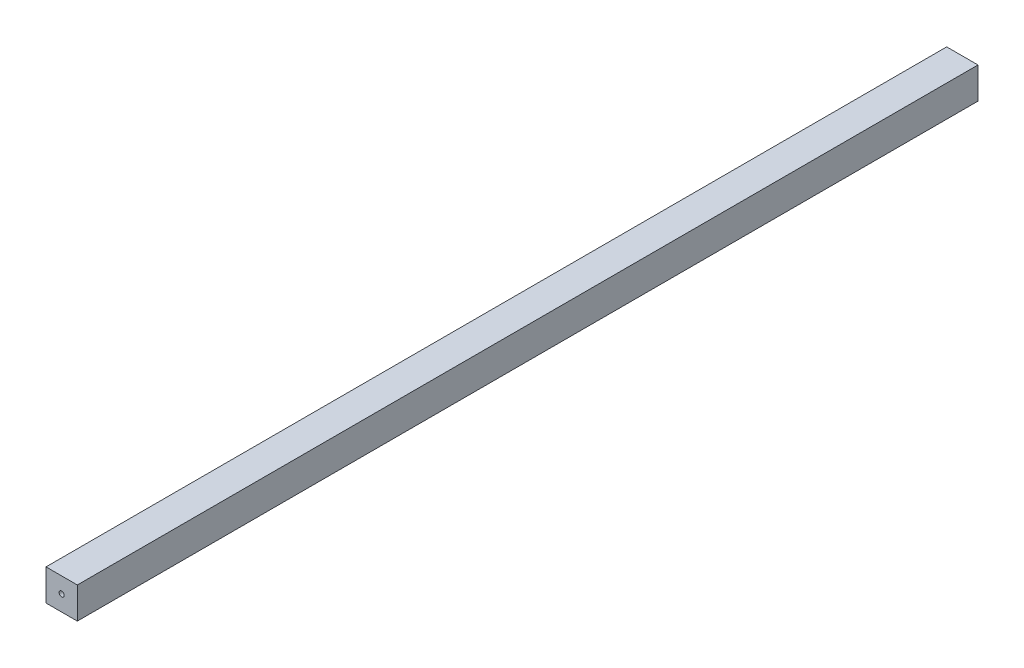
ISO-10303-21;
HEADER;
FILE_DESCRIPTION(('STEP AP214'),'2;1');
FILE_NAME('part.step','',(''),(''),'','','');
FILE_SCHEMA(('AUTOMOTIVE_DESIGN { 1 0 10303 214 1 1 1 1 }'));
ENDSEC;
DATA;
#1=APPLICATION_CONTEXT('core data for automotive mechanical design processes');
#2=APPLICATION_PROTOCOL_DEFINITION('international standard','automotive_design',2000,#1);
#3=PRODUCT_CONTEXT('',#1,'mechanical');
#4=PRODUCT('Part','Part','',(#3));
#5=PRODUCT_RELATED_PRODUCT_CATEGORY('part','',(#4));
#6=PRODUCT_DEFINITION_FORMATION('','',#4);
#7=PRODUCT_DEFINITION_CONTEXT('part definition',#1,'design');
#8=PRODUCT_DEFINITION('design','',#6,#7);
#9=PRODUCT_DEFINITION_SHAPE('','',#8);
#10=(LENGTH_UNIT() NAMED_UNIT(*) SI_UNIT(.MILLI.,.METRE.));
#11=(NAMED_UNIT(*) PLANE_ANGLE_UNIT() SI_UNIT($,.RADIAN.));
#12=(NAMED_UNIT(*) SI_UNIT($,.STERADIAN.) SOLID_ANGLE_UNIT());
#13=UNCERTAINTY_MEASURE_WITH_UNIT(LENGTH_MEASURE(1.E-05),#10,'distance_accuracy_value','');
#14=(GEOMETRIC_REPRESENTATION_CONTEXT(3) GLOBAL_UNCERTAINTY_ASSIGNED_CONTEXT((#13)) GLOBAL_UNIT_ASSIGNED_CONTEXT((#10,
#11,#12)) REPRESENTATION_CONTEXT('',''));
#15=CARTESIAN_POINT('',(0.,0.,0.));
#16=DIRECTION('',(0.,0.,1.));
#17=DIRECTION('',(1.,0.,0.));
#18=AXIS2_PLACEMENT_3D('',#15,#16,#17);
#19=CARTESIAN_POINT('',(12.7,-12.7,365.125));
#20=DIRECTION('',(-1.,0.,0.));
#21=DIRECTION('',(0.,0.,1.));
#22=AXIS2_PLACEMENT_3D('',#19,#20,#21);
#23=PLANE('',#22);
#24=DIRECTION('',(0.,1.,0.));
#25=VECTOR('',#24,1.);
#26=CARTESIAN_POINT('',(12.7,-12.7,-365.125));
#27=LINE('',#26,#25);
#28=CARTESIAN_POINT('',(12.7,-12.7,-365.125));
#29=VERTEX_POINT('',#28);
#30=CARTESIAN_POINT('',(12.7,12.7,-365.125));
#31=VERTEX_POINT('',#30);
#32=EDGE_CURVE('E98',#29,#31,#27,.T.);
#33=ORIENTED_EDGE('',*,*,#32,.T.);
#34=DIRECTION('',(0.,0.,-1.));
#35=VECTOR('',#34,1.);
#36=CARTESIAN_POINT('',(12.7,12.7,365.125));
#37=LINE('',#36,#35);
#38=CARTESIAN_POINT('',(12.7,12.7,365.125));
#39=VERTEX_POINT('',#38);
#40=EDGE_CURVE('E11',#39,#31,#37,.T.);
#41=ORIENTED_EDGE('',*,*,#40,.F.);
#42=DIRECTION('',(0.,1.,0.));
#43=VECTOR('',#42,1.);
#44=CARTESIAN_POINT('',(12.7,-12.7,365.125));
#45=LINE('',#44,#43);
#46=CARTESIAN_POINT('',(12.7,-12.7,365.125));
#47=VERTEX_POINT('',#46);
#48=EDGE_CURVE('E85',#47,#39,#45,.T.);
#49=ORIENTED_EDGE('',*,*,#48,.F.);
#50=DIRECTION('',(0.,0.,-1.));
#51=VECTOR('',#50,1.);
#52=CARTESIAN_POINT('',(12.7,-12.7,365.125));
#53=LINE('',#52,#51);
#54=EDGE_CURVE('E94',#47,#29,#53,.T.);
#55=ORIENTED_EDGE('',*,*,#54,.T.);
#56=EDGE_LOOP('',(#33,#41,#49,#55));
#57=FACE_BOUND('',#56,.T.);
#58=ADVANCED_FACE('F33',(#57),#23,.F.);
#59=CARTESIAN_POINT('',(-12.7,12.7,365.125));
#60=DIRECTION('',(0.,-1.,0.));
#61=DIRECTION('',(0.,0.,-1.));
#62=AXIS2_PLACEMENT_3D('',#59,#60,#61);
#63=PLANE('',#62);
#64=DIRECTION('',(-1.,0.,0.));
#65=VECTOR('',#64,1.);
#66=CARTESIAN_POINT('',(-12.7,12.7,-365.125));
#67=LINE('',#66,#65);
#68=CARTESIAN_POINT('',(-12.7,12.7,-365.125));
#69=VERTEX_POINT('',#68);
#70=EDGE_CURVE('E89',#31,#69,#67,.T.);
#71=ORIENTED_EDGE('',*,*,#70,.T.);
#72=DIRECTION('',(0.,0.,-1.));
#73=VECTOR('',#72,1.);
#74=CARTESIAN_POINT('',(-12.7,12.7,365.125));
#75=LINE('',#74,#73);
#76=CARTESIAN_POINT('',(-12.7,12.7,365.125));
#77=VERTEX_POINT('',#76);
#78=EDGE_CURVE('E42',#77,#69,#75,.T.);
#79=ORIENTED_EDGE('',*,*,#78,.F.);
#80=DIRECTION('',(-1.,0.,0.));
#81=VECTOR('',#80,1.);
#82=CARTESIAN_POINT('',(-12.7,12.7,365.125));
#83=LINE('',#82,#81);
#84=EDGE_CURVE('E80',#39,#77,#83,.T.);
#85=ORIENTED_EDGE('',*,*,#84,.F.);
#86=ORIENTED_EDGE('',*,*,#40,.T.);
#87=EDGE_LOOP('',(#71,#79,#85,#86));
#88=FACE_BOUND('',#87,.T.);
#89=ADVANCED_FACE('F88',(#88),#63,.F.);
#90=CARTESIAN_POINT('',(-12.7,-12.7,365.125));
#91=DIRECTION('',(1.,0.,0.));
#92=DIRECTION('',(0.,0.,-1.));
#93=AXIS2_PLACEMENT_3D('',#90,#91,#92);
#94=PLANE('',#93);
#95=DIRECTION('',(0.,-1.,0.));
#96=VECTOR('',#95,1.);
#97=CARTESIAN_POINT('',(-12.7,-12.7,-365.125));
#98=LINE('',#97,#96);
#99=CARTESIAN_POINT('',(-12.7,-12.7,-365.125));
#100=VERTEX_POINT('',#99);
#101=EDGE_CURVE('E67',#69,#100,#98,.T.);
#102=ORIENTED_EDGE('',*,*,#101,.T.);
#103=DIRECTION('',(0.,0.,-1.));
#104=VECTOR('',#103,1.);
#105=CARTESIAN_POINT('',(-12.7,-12.7,365.125));
#106=LINE('',#105,#104);
#107=CARTESIAN_POINT('',(-12.7,-12.7,365.125));
#108=VERTEX_POINT('',#107);
#109=EDGE_CURVE('E90',#108,#100,#106,.T.);
#110=ORIENTED_EDGE('',*,*,#109,.F.);
#111=DIRECTION('',(0.,-1.,0.));
#112=VECTOR('',#111,1.);
#113=CARTESIAN_POINT('',(-12.7,-12.7,365.125));
#114=LINE('',#113,#112);
#115=EDGE_CURVE('E83',#77,#108,#114,.T.);
#116=ORIENTED_EDGE('',*,*,#115,.F.);
#117=ORIENTED_EDGE('',*,*,#78,.T.);
#118=EDGE_LOOP('',(#102,#110,#116,#117));
#119=FACE_BOUND('',#118,.T.);
#120=ADVANCED_FACE('F92',(#119),#94,.F.);
#121=CARTESIAN_POINT('',(-12.7,-12.7,365.125));
#122=DIRECTION('',(0.,1.,0.));
#123=DIRECTION('',(0.,0.,1.));
#124=AXIS2_PLACEMENT_3D('',#121,#122,#123);
#125=PLANE('',#124);
#126=DIRECTION('',(1.,0.,0.));
#127=VECTOR('',#126,1.);
#128=CARTESIAN_POINT('',(-12.7,-12.7,-365.125));
#129=LINE('',#128,#127);
#130=EDGE_CURVE('E73',#100,#29,#129,.T.);
#131=ORIENTED_EDGE('',*,*,#130,.T.);
#132=ORIENTED_EDGE('',*,*,#54,.F.);
#133=DIRECTION('',(1.,0.,0.));
#134=VECTOR('',#133,1.);
#135=CARTESIAN_POINT('',(-12.7,-12.7,365.125));
#136=LINE('',#135,#134);
#137=EDGE_CURVE('E50',#108,#47,#136,.T.);
#138=ORIENTED_EDGE('',*,*,#137,.F.);
#139=ORIENTED_EDGE('',*,*,#109,.T.);
#140=EDGE_LOOP('',(#131,#132,#138,#139));
#141=FACE_BOUND('',#140,.T.);
#142=ADVANCED_FACE('F105',(#141),#125,.F.);
#143=CARTESIAN_POINT('',(0.,0.,365.125));
#144=DIRECTION('',(0.,0.,-1.));
#145=DIRECTION('',(-1.,0.,0.));
#146=AXIS2_PLACEMENT_3D('',#143,#144,#145);
#147=PLANE('',#146);
#148=CARTESIAN_POINT('',(0.,0.,365.125));
#149=DIRECTION('',(0.,0.,1.));
#150=DIRECTION('',(1.,0.,0.));
#151=AXIS2_PLACEMENT_3D('',#148,#149,#150);
#152=CIRCLE('',#151,2.0828);
#153=CARTESIAN_POINT('',(2.0828,0.,365.125));
#154=VERTEX_POINT('',#153);
#155=EDGE_CURVE('E111',#154,#154,#152,.T.);
#156=ORIENTED_EDGE('',*,*,#155,.F.);
#157=EDGE_LOOP('',(#156));
#158=FACE_BOUND('',#157,.T.);
#159=ORIENTED_EDGE('',*,*,#48,.T.);
#160=ORIENTED_EDGE('',*,*,#84,.T.);
#161=ORIENTED_EDGE('',*,*,#115,.T.);
#162=ORIENTED_EDGE('',*,*,#137,.T.);
#163=EDGE_LOOP('',(#159,#160,#161,#162));
#164=FACE_BOUND('',#163,.T.);
#165=ADVANCED_FACE('F81',(#158,#164),#147,.F.);
#166=CARTESIAN_POINT('',(0.,0.,-365.125));
#167=DIRECTION('',(0.,0.,-1.));
#168=DIRECTION('',(-1.,0.,0.));
#169=AXIS2_PLACEMENT_3D('',#166,#167,#168);
#170=PLANE('',#169);
#171=CARTESIAN_POINT('',(0.,0.,-365.125));
#172=DIRECTION('',(0.,0.,-1.));
#173=DIRECTION('',(-1.,0.,0.));
#174=AXIS2_PLACEMENT_3D('',#171,#172,#173);
#175=CIRCLE('',#174,2.0828);
#176=CARTESIAN_POINT('',(-2.0828,0.,-365.125));
#177=VERTEX_POINT('',#176);
#178=EDGE_CURVE('E36',#177,#177,#175,.T.);
#179=ORIENTED_EDGE('',*,*,#178,.F.);
#180=EDGE_LOOP('',(#179));
#181=FACE_BOUND('',#180,.T.);
#182=ORIENTED_EDGE('',*,*,#32,.F.);
#183=ORIENTED_EDGE('',*,*,#130,.F.);
#184=ORIENTED_EDGE('',*,*,#101,.F.);
#185=ORIENTED_EDGE('',*,*,#70,.F.);
#186=EDGE_LOOP('',(#182,#183,#184,#185));
#187=FACE_BOUND('',#186,.T.);
#188=ADVANCED_FACE('F108',(#181,#187),#170,.T.);
#189=CARTESIAN_POINT('',(0.,0.,-447.167));
#190=DIRECTION('',(0.,0.,1.));
#191=DIRECTION('',(1.,0.,0.));
#192=AXIS2_PLACEMENT_3D('',#189,#190,#191);
#193=CYLINDRICAL_SURFACE('',#192,2.0828);
#194=ORIENTED_EDGE('',*,*,#178,.T.);
#195=EDGE_LOOP('',(#194));
#196=FACE_BOUND('',#195,.T.);
#197=ORIENTED_EDGE('',*,*,#155,.T.);
#198=EDGE_LOOP('',(#197));
#199=FACE_BOUND('',#198,.T.);
#200=ADVANCED_FACE('F118',(#196,#199),#193,.F.);
#201=CLOSED_SHELL('',(#58,#89,#120,#142,#165,#188,#200));
#202=MANIFOLD_SOLID_BREP('B2',#201);
#203=ADVANCED_BREP_SHAPE_REPRESENTATION('',(#18,#202),#14);
#204=SHAPE_DEFINITION_REPRESENTATION(#9,#203);
ENDSEC;
END-ISO-10303-21;
